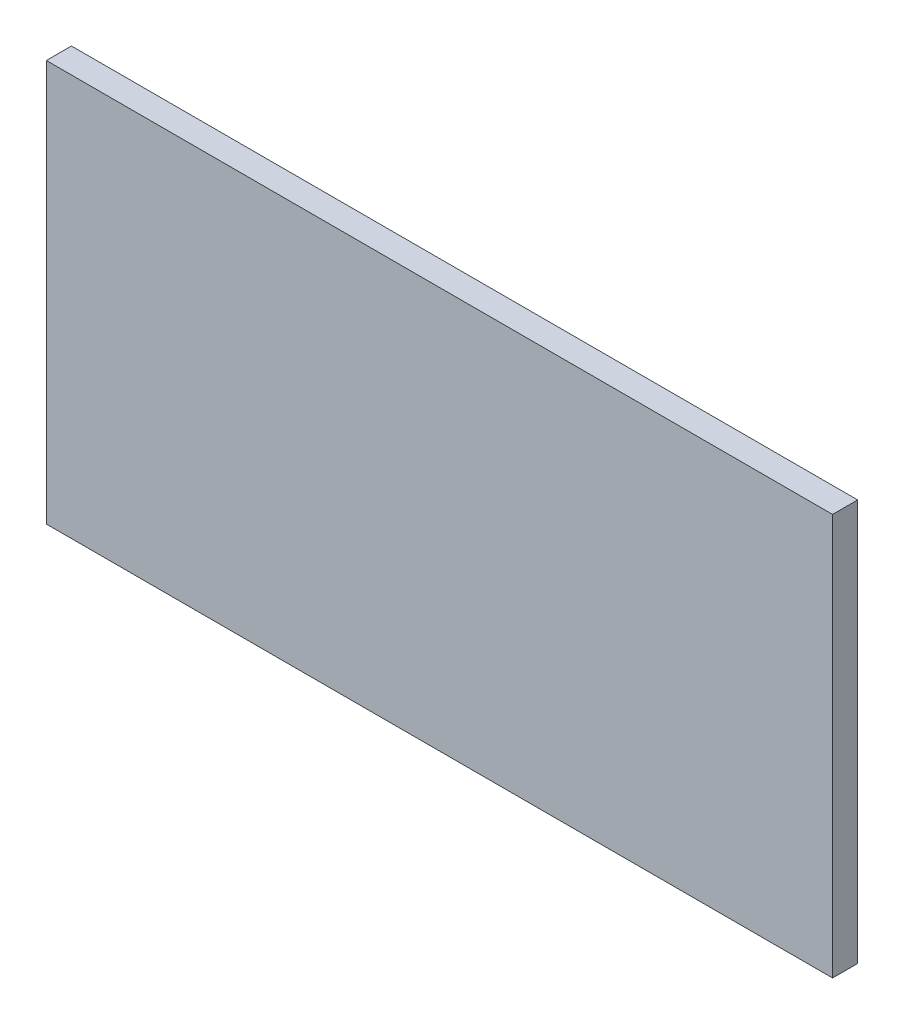
ISO-10303-21;
HEADER;
FILE_DESCRIPTION(('STEP AP214'),'2;1');
FILE_NAME('part.step','',(''),(''),'','','');
FILE_SCHEMA(('AUTOMOTIVE_DESIGN { 1 0 10303 214 1 1 1 1 }'));
ENDSEC;
DATA;
#1=APPLICATION_CONTEXT('core data for automotive mechanical design processes');
#2=APPLICATION_PROTOCOL_DEFINITION('international standard','automotive_design',2000,#1);
#3=PRODUCT_CONTEXT('',#1,'mechanical');
#4=PRODUCT('Part','Part','',(#3));
#5=PRODUCT_RELATED_PRODUCT_CATEGORY('part','',(#4));
#6=PRODUCT_DEFINITION_FORMATION('','',#4);
#7=PRODUCT_DEFINITION_CONTEXT('part definition',#1,'design');
#8=PRODUCT_DEFINITION('design','',#6,#7);
#9=PRODUCT_DEFINITION_SHAPE('','',#8);
#10=(LENGTH_UNIT() NAMED_UNIT(*) SI_UNIT(.MILLI.,.METRE.));
#11=(NAMED_UNIT(*) PLANE_ANGLE_UNIT() SI_UNIT($,.RADIAN.));
#12=(NAMED_UNIT(*) SI_UNIT($,.STERADIAN.) SOLID_ANGLE_UNIT());
#13=UNCERTAINTY_MEASURE_WITH_UNIT(LENGTH_MEASURE(1.E-05),#10,'distance_accuracy_value','');
#14=(GEOMETRIC_REPRESENTATION_CONTEXT(3) GLOBAL_UNCERTAINTY_ASSIGNED_CONTEXT((#13)) GLOBAL_UNIT_ASSIGNED_CONTEXT((#10,
#11,#12)) REPRESENTATION_CONTEXT('',''));
#15=CARTESIAN_POINT('',(0.,0.,0.));
#16=DIRECTION('',(0.,0.,1.));
#17=DIRECTION('',(1.,0.,0.));
#18=AXIS2_PLACEMENT_3D('',#15,#16,#17);
#19=CARTESIAN_POINT('',(-282.,-144.,18.));
#20=DIRECTION('',(1.,0.,0.));
#21=DIRECTION('',(0.,0.,-1.));
#22=AXIS2_PLACEMENT_3D('',#19,#20,#21);
#23=PLANE('',#22);
#24=DIRECTION('',(0.,-1.,0.));
#25=VECTOR('',#24,1.);
#26=CARTESIAN_POINT('',(-282.,-144.,0.));
#27=LINE('',#26,#25);
#28=CARTESIAN_POINT('',(-282.,144.,0.));
#29=VERTEX_POINT('',#28);
#30=CARTESIAN_POINT('',(-282.,-144.,0.));
#31=VERTEX_POINT('',#30);
#32=EDGE_CURVE('E95',#29,#31,#27,.T.);
#33=ORIENTED_EDGE('',*,*,#32,.T.);
#34=DIRECTION('',(0.,0.,-1.));
#35=VECTOR('',#34,1.);
#36=CARTESIAN_POINT('',(-282.,-144.,18.));
#37=LINE('',#36,#35);
#38=CARTESIAN_POINT('',(-282.,-144.,18.));
#39=VERTEX_POINT('',#38);
#40=EDGE_CURVE('E11',#39,#31,#37,.T.);
#41=ORIENTED_EDGE('',*,*,#40,.F.);
#42=DIRECTION('',(0.,-1.,0.));
#43=VECTOR('',#42,1.);
#44=CARTESIAN_POINT('',(-282.,-144.,18.));
#45=LINE('',#44,#43);
#46=CARTESIAN_POINT('',(-282.,144.,18.));
#47=VERTEX_POINT('',#46);
#48=EDGE_CURVE('E83',#47,#39,#45,.T.);
#49=ORIENTED_EDGE('',*,*,#48,.F.);
#50=DIRECTION('',(0.,0.,-1.));
#51=VECTOR('',#50,1.);
#52=CARTESIAN_POINT('',(-282.,144.,18.));
#53=LINE('',#52,#51);
#54=EDGE_CURVE('E91',#47,#29,#53,.T.);
#55=ORIENTED_EDGE('',*,*,#54,.T.);
#56=EDGE_LOOP('',(#33,#41,#49,#55));
#57=FACE_BOUND('',#56,.T.);
#58=ADVANCED_FACE('F32',(#57),#23,.F.);
#59=CARTESIAN_POINT('',(282.,-144.,18.));
#60=DIRECTION('',(0.,1.,0.));
#61=DIRECTION('',(-1.,0.,0.));
#62=AXIS2_PLACEMENT_3D('',#59,#60,#61);
#63=PLANE('',#62);
#64=DIRECTION('',(1.,0.,0.));
#65=VECTOR('',#64,1.);
#66=CARTESIAN_POINT('',(282.,-144.,0.));
#67=LINE('',#66,#65);
#68=CARTESIAN_POINT('',(282.,-144.,0.));
#69=VERTEX_POINT('',#68);
#70=EDGE_CURVE('E87',#31,#69,#67,.T.);
#71=ORIENTED_EDGE('',*,*,#70,.T.);
#72=DIRECTION('',(0.,0.,-1.));
#73=VECTOR('',#72,1.);
#74=CARTESIAN_POINT('',(282.,-144.,18.));
#75=LINE('',#74,#73);
#76=CARTESIAN_POINT('',(282.,-144.,18.));
#77=VERTEX_POINT('',#76);
#78=EDGE_CURVE('E40',#77,#69,#75,.T.);
#79=ORIENTED_EDGE('',*,*,#78,.F.);
#80=DIRECTION('',(1.,0.,0.));
#81=VECTOR('',#80,1.);
#82=CARTESIAN_POINT('',(282.,-144.,18.));
#83=LINE('',#82,#81);
#84=EDGE_CURVE('E78',#39,#77,#83,.T.);
#85=ORIENTED_EDGE('',*,*,#84,.F.);
#86=ORIENTED_EDGE('',*,*,#40,.T.);
#87=EDGE_LOOP('',(#71,#79,#85,#86));
#88=FACE_BOUND('',#87,.T.);
#89=ADVANCED_FACE('F86',(#88),#63,.F.);
#90=CARTESIAN_POINT('',(282.,-144.,18.));
#91=DIRECTION('',(-1.,0.,0.));
#92=DIRECTION('',(0.,0.,1.));
#93=AXIS2_PLACEMENT_3D('',#90,#91,#92);
#94=PLANE('',#93);
#95=DIRECTION('',(0.,1.,0.));
#96=VECTOR('',#95,1.);
#97=CARTESIAN_POINT('',(282.,-144.,0.));
#98=LINE('',#97,#96);
#99=CARTESIAN_POINT('',(282.,144.,0.));
#100=VERTEX_POINT('',#99);
#101=EDGE_CURVE('E65',#69,#100,#98,.T.);
#102=ORIENTED_EDGE('',*,*,#101,.T.);
#103=DIRECTION('',(0.,0.,-1.));
#104=VECTOR('',#103,1.);
#105=CARTESIAN_POINT('',(282.,144.,18.));
#106=LINE('',#105,#104);
#107=CARTESIAN_POINT('',(282.,144.,18.));
#108=VERTEX_POINT('',#107);
#109=EDGE_CURVE('E88',#108,#100,#106,.T.);
#110=ORIENTED_EDGE('',*,*,#109,.F.);
#111=DIRECTION('',(0.,1.,0.));
#112=VECTOR('',#111,1.);
#113=CARTESIAN_POINT('',(282.,-144.,18.));
#114=LINE('',#113,#112);
#115=EDGE_CURVE('E81',#77,#108,#114,.T.);
#116=ORIENTED_EDGE('',*,*,#115,.F.);
#117=ORIENTED_EDGE('',*,*,#78,.T.);
#118=EDGE_LOOP('',(#102,#110,#116,#117));
#119=FACE_BOUND('',#118,.T.);
#120=ADVANCED_FACE('F89',(#119),#94,.F.);
#121=CARTESIAN_POINT('',(282.,144.,18.));
#122=DIRECTION('',(0.,-1.,0.));
#123=DIRECTION('',(1.,0.,0.));
#124=AXIS2_PLACEMENT_3D('',#121,#122,#123);
#125=PLANE('',#124);
#126=DIRECTION('',(-1.,0.,0.));
#127=VECTOR('',#126,1.);
#128=CARTESIAN_POINT('',(282.,144.,0.));
#129=LINE('',#128,#127);
#130=EDGE_CURVE('E71',#100,#29,#129,.T.);
#131=ORIENTED_EDGE('',*,*,#130,.T.);
#132=ORIENTED_EDGE('',*,*,#54,.F.);
#133=DIRECTION('',(-1.,0.,0.));
#134=VECTOR('',#133,1.);
#135=CARTESIAN_POINT('',(282.,144.,18.));
#136=LINE('',#135,#134);
#137=EDGE_CURVE('E48',#108,#47,#136,.T.);
#138=ORIENTED_EDGE('',*,*,#137,.F.);
#139=ORIENTED_EDGE('',*,*,#109,.T.);
#140=EDGE_LOOP('',(#131,#132,#138,#139));
#141=FACE_BOUND('',#140,.T.);
#142=ADVANCED_FACE('F102',(#141),#125,.F.);
#143=CARTESIAN_POINT('',(0.,0.,18.));
#144=DIRECTION('',(0.,0.,1.));
#145=DIRECTION('',(1.,0.,0.));
#146=AXIS2_PLACEMENT_3D('',#143,#144,#145);
#147=PLANE('',#146);
#148=ORIENTED_EDGE('',*,*,#48,.T.);
#149=ORIENTED_EDGE('',*,*,#84,.T.);
#150=ORIENTED_EDGE('',*,*,#115,.T.);
#151=ORIENTED_EDGE('',*,*,#137,.T.);
#152=EDGE_LOOP('',(#148,#149,#150,#151));
#153=FACE_BOUND('',#152,.T.);
#154=ADVANCED_FACE('F79',(#153),#147,.T.);
#155=CARTESIAN_POINT('',(0.,0.,0.));
#156=DIRECTION('',(0.,0.,1.));
#157=DIRECTION('',(1.,0.,0.));
#158=AXIS2_PLACEMENT_3D('',#155,#156,#157);
#159=PLANE('',#158);
#160=ORIENTED_EDGE('',*,*,#32,.F.);
#161=ORIENTED_EDGE('',*,*,#130,.F.);
#162=ORIENTED_EDGE('',*,*,#101,.F.);
#163=ORIENTED_EDGE('',*,*,#70,.F.);
#164=EDGE_LOOP('',(#160,#161,#162,#163));
#165=FACE_BOUND('',#164,.T.);
#166=ADVANCED_FACE('F105',(#165),#159,.F.);
#167=CLOSED_SHELL('',(#58,#89,#120,#142,#154,#166));
#168=MANIFOLD_SOLID_BREP('B2',#167);
#169=ADVANCED_BREP_SHAPE_REPRESENTATION('',(#18,#168),#14);
#170=SHAPE_DEFINITION_REPRESENTATION(#9,#169);
ENDSEC;
END-ISO-10303-21;
